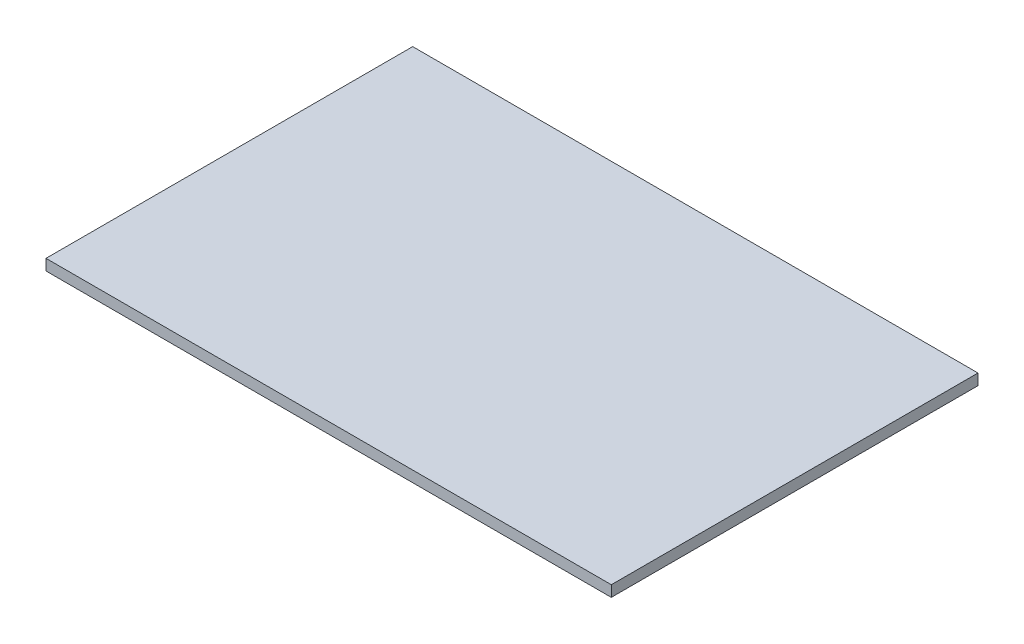
ISO-10303-21;
HEADER;
FILE_DESCRIPTION(('STEP AP214'),'2;1');
FILE_NAME('part.step','',(''),(''),'','','');
FILE_SCHEMA(('AUTOMOTIVE_DESIGN { 1 0 10303 214 1 1 1 1 }'));
ENDSEC;
DATA;
#1=APPLICATION_CONTEXT('core data for automotive mechanical design processes');
#2=APPLICATION_PROTOCOL_DEFINITION('international standard','automotive_design',2000,#1);
#3=PRODUCT_CONTEXT('',#1,'mechanical');
#4=PRODUCT('Part','Part','',(#3));
#5=PRODUCT_RELATED_PRODUCT_CATEGORY('part','',(#4));
#6=PRODUCT_DEFINITION_FORMATION('','',#4);
#7=PRODUCT_DEFINITION_CONTEXT('part definition',#1,'design');
#8=PRODUCT_DEFINITION('design','',#6,#7);
#9=PRODUCT_DEFINITION_SHAPE('','',#8);
#10=(LENGTH_UNIT() NAMED_UNIT(*) SI_UNIT(.MILLI.,.METRE.));
#11=(NAMED_UNIT(*) PLANE_ANGLE_UNIT() SI_UNIT($,.RADIAN.));
#12=(NAMED_UNIT(*) SI_UNIT($,.STERADIAN.) SOLID_ANGLE_UNIT());
#13=UNCERTAINTY_MEASURE_WITH_UNIT(LENGTH_MEASURE(1.E-05),#10,'distance_accuracy_value','');
#14=(GEOMETRIC_REPRESENTATION_CONTEXT(3) GLOBAL_UNCERTAINTY_ASSIGNED_CONTEXT((#13)) GLOBAL_UNIT_ASSIGNED_CONTEXT((#10,
#11,#12)) REPRESENTATION_CONTEXT('',''));
#15=CARTESIAN_POINT('',(0.,0.,0.));
#16=DIRECTION('',(0.,0.,1.));
#17=DIRECTION('',(1.,0.,0.));
#18=AXIS2_PLACEMENT_3D('',#15,#16,#17);
#19=CARTESIAN_POINT('',(469.9,18.25625,304.8));
#20=DIRECTION('',(-1.,0.,0.));
#21=DIRECTION('',(0.,0.,1.));
#22=AXIS2_PLACEMENT_3D('',#19,#20,#21);
#23=PLANE('',#22);
#24=DIRECTION('',(0.,0.,-1.));
#25=VECTOR('',#24,1.);
#26=CARTESIAN_POINT('',(469.9,0.,304.8));
#27=LINE('',#26,#25);
#28=CARTESIAN_POINT('',(469.9,0.,304.8));
#29=VERTEX_POINT('',#28);
#30=CARTESIAN_POINT('',(469.9,0.,-304.8));
#31=VERTEX_POINT('',#30);
#32=EDGE_CURVE('E107',#29,#31,#27,.T.);
#33=ORIENTED_EDGE('',*,*,#32,.T.);
#34=DIRECTION('',(0.,-1.,0.));
#35=VECTOR('',#34,1.);
#36=CARTESIAN_POINT('',(469.9,18.25625,-304.8));
#37=LINE('',#36,#35);
#38=CARTESIAN_POINT('',(469.9,18.25625,-304.8));
#39=VERTEX_POINT('',#38);
#40=EDGE_CURVE('E11',#39,#31,#37,.T.);
#41=ORIENTED_EDGE('',*,*,#40,.F.);
#42=DIRECTION('',(0.,0.,-1.));
#43=VECTOR('',#42,1.);
#44=CARTESIAN_POINT('',(469.9,18.25625,304.8));
#45=LINE('',#44,#43);
#46=CARTESIAN_POINT('',(469.9,18.25625,304.8));
#47=VERTEX_POINT('',#46);
#48=EDGE_CURVE('E91',#47,#39,#45,.T.);
#49=ORIENTED_EDGE('',*,*,#48,.F.);
#50=DIRECTION('',(0.,-1.,0.));
#51=VECTOR('',#50,1.);
#52=CARTESIAN_POINT('',(469.9,18.25625,304.8));
#53=LINE('',#52,#51);
#54=EDGE_CURVE('E103',#47,#29,#53,.T.);
#55=ORIENTED_EDGE('',*,*,#54,.T.);
#56=EDGE_LOOP('',(#33,#41,#49,#55));
#57=FACE_BOUND('',#56,.T.);
#58=ADVANCED_FACE('F39',(#57),#23,.F.);
#59=CARTESIAN_POINT('',(-469.9,18.25625,-304.8));
#60=DIRECTION('',(0.,0.,1.));
#61=DIRECTION('',(1.,0.,0.));
#62=AXIS2_PLACEMENT_3D('',#59,#60,#61);
#63=PLANE('',#62);
#64=DIRECTION('',(-1.,0.,0.));
#65=VECTOR('',#64,1.);
#66=CARTESIAN_POINT('',(-469.9,0.,-304.8));
#67=LINE('',#66,#65);
#68=CARTESIAN_POINT('',(-469.9,0.,-304.8));
#69=VERTEX_POINT('',#68);
#70=EDGE_CURVE('E96',#31,#69,#67,.T.);
#71=ORIENTED_EDGE('',*,*,#70,.T.);
#72=DIRECTION('',(0.,-1.,0.));
#73=VECTOR('',#72,1.);
#74=CARTESIAN_POINT('',(-469.9,18.25625,-304.8));
#75=LINE('',#74,#73);
#76=CARTESIAN_POINT('',(-469.9,18.25625,-304.8));
#77=VERTEX_POINT('',#76);
#78=EDGE_CURVE('E48',#77,#69,#75,.T.);
#79=ORIENTED_EDGE('',*,*,#78,.F.);
#80=DIRECTION('',(-1.,0.,0.));
#81=VECTOR('',#80,1.);
#82=CARTESIAN_POINT('',(-469.9,18.25625,-304.8));
#83=LINE('',#82,#81);
#84=EDGE_CURVE('E86',#39,#77,#83,.T.);
#85=ORIENTED_EDGE('',*,*,#84,.F.);
#86=ORIENTED_EDGE('',*,*,#40,.T.);
#87=EDGE_LOOP('',(#71,#79,#85,#86));
#88=FACE_BOUND('',#87,.T.);
#89=ADVANCED_FACE('F95',(#88),#63,.F.);
#90=CARTESIAN_POINT('',(-469.9,18.25625,304.8));
#91=DIRECTION('',(1.,0.,0.));
#92=DIRECTION('',(0.,0.,-1.));
#93=AXIS2_PLACEMENT_3D('',#90,#91,#92);
#94=PLANE('',#93);
#95=DIRECTION('',(0.,0.,1.));
#96=VECTOR('',#95,1.);
#97=CARTESIAN_POINT('',(-469.9,0.,304.8));
#98=LINE('',#97,#96);
#99=CARTESIAN_POINT('',(-469.9,0.,304.8));
#100=VERTEX_POINT('',#99);
#101=EDGE_CURVE('E73',#69,#100,#98,.T.);
#102=ORIENTED_EDGE('',*,*,#101,.T.);
#103=DIRECTION('',(0.,-1.,0.));
#104=VECTOR('',#103,1.);
#105=CARTESIAN_POINT('',(-469.9,18.25625,304.8));
#106=LINE('',#105,#104);
#107=CARTESIAN_POINT('',(-469.9,18.25625,304.8));
#108=VERTEX_POINT('',#107);
#109=EDGE_CURVE('E98',#108,#100,#106,.T.);
#110=ORIENTED_EDGE('',*,*,#109,.F.);
#111=DIRECTION('',(0.,0.,1.));
#112=VECTOR('',#111,1.);
#113=CARTESIAN_POINT('',(-469.9,18.25625,304.8));
#114=LINE('',#113,#112);
#115=EDGE_CURVE('E89',#77,#108,#114,.T.);
#116=ORIENTED_EDGE('',*,*,#115,.F.);
#117=ORIENTED_EDGE('',*,*,#78,.T.);
#118=EDGE_LOOP('',(#102,#110,#116,#117));
#119=FACE_BOUND('',#118,.T.);
#120=ADVANCED_FACE('F99',(#119),#94,.F.);
#121=CARTESIAN_POINT('',(-469.9,18.25625,304.8));
#122=DIRECTION('',(0.,0.,-1.));
#123=DIRECTION('',(-1.,0.,0.));
#124=AXIS2_PLACEMENT_3D('',#121,#122,#123);
#125=PLANE('',#124);
#126=DIRECTION('',(1.,0.,0.));
#127=VECTOR('',#126,1.);
#128=CARTESIAN_POINT('',(-469.9,0.,304.8));
#129=LINE('',#128,#127);
#130=EDGE_CURVE('E79',#100,#29,#129,.T.);
#131=ORIENTED_EDGE('',*,*,#130,.T.);
#132=ORIENTED_EDGE('',*,*,#54,.F.);
#133=DIRECTION('',(1.,0.,0.));
#134=VECTOR('',#133,1.);
#135=CARTESIAN_POINT('',(-469.9,18.25625,304.8));
#136=LINE('',#135,#134);
#137=EDGE_CURVE('E56',#108,#47,#136,.T.);
#138=ORIENTED_EDGE('',*,*,#137,.F.);
#139=ORIENTED_EDGE('',*,*,#109,.T.);
#140=EDGE_LOOP('',(#131,#132,#138,#139));
#141=FACE_BOUND('',#140,.T.);
#142=ADVANCED_FACE('F120',(#141),#125,.F.);
#143=CARTESIAN_POINT('',(0.,18.25625,0.));
#144=DIRECTION('',(0.,-1.,0.));
#145=DIRECTION('',(0.,0.,-1.));
#146=AXIS2_PLACEMENT_3D('',#143,#144,#145);
#147=PLANE('',#146);
#148=ORIENTED_EDGE('',*,*,#48,.T.);
#149=ORIENTED_EDGE('',*,*,#84,.T.);
#150=ORIENTED_EDGE('',*,*,#115,.T.);
#151=ORIENTED_EDGE('',*,*,#137,.T.);
#152=EDGE_LOOP('',(#148,#149,#150,#151));
#153=FACE_BOUND('',#152,.T.);
#154=ADVANCED_FACE('F87',(#153),#147,.F.);
#155=CARTESIAN_POINT('',(0.,0.,0.));
#156=DIRECTION('',(0.,-1.,0.));
#157=DIRECTION('',(0.,0.,-1.));
#158=AXIS2_PLACEMENT_3D('',#155,#156,#157);
#159=PLANE('',#158);
#160=ORIENTED_EDGE('',*,*,#32,.F.);
#161=ORIENTED_EDGE('',*,*,#130,.F.);
#162=ORIENTED_EDGE('',*,*,#101,.F.);
#163=ORIENTED_EDGE('',*,*,#70,.F.);
#164=EDGE_LOOP('',(#160,#161,#162,#163));
#165=FACE_BOUND('',#164,.T.);
#166=ADVANCED_FACE('F123',(#165),#159,.T.);
#167=CLOSED_SHELL('',(#58,#89,#120,#142,#154,#166));
#168=MANIFOLD_SOLID_BREP('B2',#167);
#169=ADVANCED_BREP_SHAPE_REPRESENTATION('',(#18,#168),#14);
#170=SHAPE_DEFINITION_REPRESENTATION(#9,#169);
ENDSEC;
END-ISO-10303-21;
